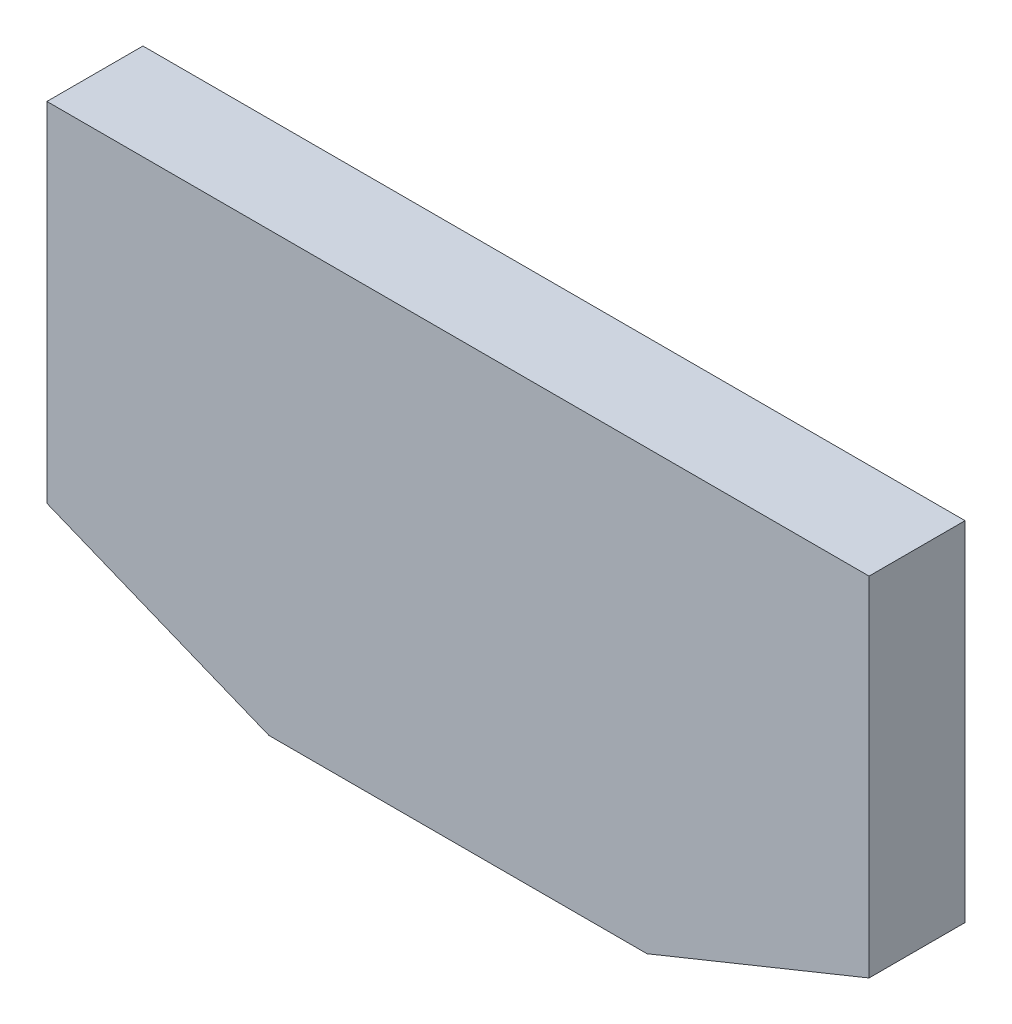
ISO-10303-21;
HEADER;
FILE_DESCRIPTION(('STEP AP214'),'2;1');
FILE_NAME('part.step','',(''),(''),'','','');
FILE_SCHEMA(('AUTOMOTIVE_DESIGN { 1 0 10303 214 1 1 1 1 }'));
ENDSEC;
DATA;
#1=APPLICATION_CONTEXT('core data for automotive mechanical design processes');
#2=APPLICATION_PROTOCOL_DEFINITION('international standard','automotive_design',2000,#1);
#3=PRODUCT_CONTEXT('',#1,'mechanical');
#4=PRODUCT('Part','Part','',(#3));
#5=PRODUCT_RELATED_PRODUCT_CATEGORY('part','',(#4));
#6=PRODUCT_DEFINITION_FORMATION('','',#4);
#7=PRODUCT_DEFINITION_CONTEXT('part definition',#1,'design');
#8=PRODUCT_DEFINITION('design','',#6,#7);
#9=PRODUCT_DEFINITION_SHAPE('','',#8);
#10=(LENGTH_UNIT() NAMED_UNIT(*) SI_UNIT(.MILLI.,.METRE.));
#11=(NAMED_UNIT(*) PLANE_ANGLE_UNIT() SI_UNIT($,.RADIAN.));
#12=(NAMED_UNIT(*) SI_UNIT($,.STERADIAN.) SOLID_ANGLE_UNIT());
#13=UNCERTAINTY_MEASURE_WITH_UNIT(LENGTH_MEASURE(1.E-05),#10,'distance_accuracy_value','');
#14=(GEOMETRIC_REPRESENTATION_CONTEXT(3) GLOBAL_UNCERTAINTY_ASSIGNED_CONTEXT((#13)) GLOBAL_UNIT_ASSIGNED_CONTEXT((#10,
#11,#12)) REPRESENTATION_CONTEXT('',''));
#15=CARTESIAN_POINT('',(0.,0.,0.));
#16=DIRECTION('',(0.,0.,1.));
#17=DIRECTION('',(1.,0.,0.));
#18=AXIS2_PLACEMENT_3D('',#15,#16,#17);
#19=CARTESIAN_POINT('',(685.,365.,0.));
#20=DIRECTION('',(0.,0.,1.));
#21=DIRECTION('',(1.,0.,0.));
#22=AXIS2_PLACEMENT_3D('',#19,#20,#21);
#23=PLANE('',#22);
#24=DIRECTION('',(-1.,0.,0.));
#25=VECTOR('',#24,1.);
#26=CARTESIAN_POINT('',(685.,75.,0.));
#27=LINE('',#26,#25);
#28=CARTESIAN_POINT('',(685.,75.,0.));
#29=VERTEX_POINT('',#28);
#30=CARTESIAN_POINT('',(0.,75.,0.));
#31=VERTEX_POINT('',#30);
#32=EDGE_CURVE('E71',#29,#31,#27,.T.);
#33=ORIENTED_EDGE('',*,*,#32,.F.);
#34=DIRECTION('',(0.926739268223405,0.375705108739218,0.));
#35=VECTOR('',#34,1.);
#36=CARTESIAN_POINT('',(685.,75.,0.));
#37=LINE('',#36,#35);
#38=CARTESIAN_POINT('',(500.,0.,0.));
#39=VERTEX_POINT('',#38);
#40=EDGE_CURVE('E115',#39,#29,#37,.T.);
#41=ORIENTED_EDGE('',*,*,#40,.F.);
#42=DIRECTION('',(1.,0.,0.));
#43=VECTOR('',#42,1.);
#44=CARTESIAN_POINT('',(185.,0.,0.));
#45=LINE('',#44,#43);
#46=CARTESIAN_POINT('',(185.,0.,0.));
#47=VERTEX_POINT('',#46);
#48=EDGE_CURVE('E63',#47,#39,#45,.T.);
#49=ORIENTED_EDGE('',*,*,#48,.F.);
#50=DIRECTION('',(0.926739268223405,-0.375705108739218,0.));
#51=VECTOR('',#50,1.);
#52=CARTESIAN_POINT('',(0.,75.,0.));
#53=LINE('',#52,#51);
#54=EDGE_CURVE('E111',#31,#47,#53,.T.);
#55=ORIENTED_EDGE('',*,*,#54,.F.);
#56=EDGE_LOOP('',(#33,#41,#49,#55));
#57=FACE_BOUND('',#56,.T.);
#58=ADVANCED_FACE('F31',(#57),#23,.F.);
#59=CARTESIAN_POINT('',(0.,365.,7.));
#60=DIRECTION('',(0.,-1.,0.));
#61=DIRECTION('',(0.,0.,-1.));
#62=AXIS2_PLACEMENT_3D('',#59,#60,#61);
#63=PLANE('',#62);
#64=DIRECTION('',(0.,0.,-1.));
#65=VECTOR('',#64,1.);
#66=CARTESIAN_POINT('',(685.,365.,7.));
#67=LINE('',#66,#65);
#68=CARTESIAN_POINT('',(685.,365.,7.));
#69=VERTEX_POINT('',#68);
#70=CARTESIAN_POINT('',(685.,365.,-73.));
#71=VERTEX_POINT('',#70);
#72=EDGE_CURVE('E107',#69,#71,#67,.T.);
#73=ORIENTED_EDGE('',*,*,#72,.T.);
#74=DIRECTION('',(1.,0.,0.));
#75=VECTOR('',#74,1.);
#76=CARTESIAN_POINT('',(0.,365.,-73.));
#77=LINE('',#76,#75);
#78=CARTESIAN_POINT('',(0.,365.,-73.));
#79=VERTEX_POINT('',#78);
#80=EDGE_CURVE('E151',#79,#71,#77,.T.);
#81=ORIENTED_EDGE('',*,*,#80,.F.);
#82=DIRECTION('',(0.,0.,-1.));
#83=VECTOR('',#82,1.);
#84=CARTESIAN_POINT('',(0.,365.,7.));
#85=LINE('',#84,#83);
#86=CARTESIAN_POINT('',(0.,365.,7.));
#87=VERTEX_POINT('',#86);
#88=EDGE_CURVE('E11',#87,#79,#85,.T.);
#89=ORIENTED_EDGE('',*,*,#88,.F.);
#90=DIRECTION('',(-1.,0.,0.));
#91=VECTOR('',#90,1.);
#92=CARTESIAN_POINT('',(0.,365.,7.));
#93=LINE('',#92,#91);
#94=EDGE_CURVE('E117',#69,#87,#93,.T.);
#95=ORIENTED_EDGE('',*,*,#94,.F.);
#96=EDGE_LOOP('',(#73,#81,#89,#95));
#97=FACE_BOUND('',#96,.T.);
#98=ADVANCED_FACE('F33',(#97),#63,.F.);
#99=CARTESIAN_POINT('',(0.,75.,7.));
#100=DIRECTION('',(1.,0.,0.));
#101=DIRECTION('',(0.,0.,-1.));
#102=AXIS2_PLACEMENT_3D('',#99,#100,#101);
#103=PLANE('',#102);
#104=ORIENTED_EDGE('',*,*,#88,.T.);
#105=DIRECTION('',(0.,1.,0.));
#106=VECTOR('',#105,1.);
#107=CARTESIAN_POINT('',(0.,75.,-73.));
#108=LINE('',#107,#106);
#109=CARTESIAN_POINT('',(0.,75.,-73.));
#110=VERTEX_POINT('',#109);
#111=EDGE_CURVE('E134',#110,#79,#108,.T.);
#112=ORIENTED_EDGE('',*,*,#111,.F.);
#113=DIRECTION('',(0.,0.,1.));
#114=VECTOR('',#113,1.);
#115=CARTESIAN_POINT('',(0.,75.,-73.));
#116=LINE('',#115,#114);
#117=EDGE_CURVE('E131',#110,#31,#116,.T.);
#118=ORIENTED_EDGE('',*,*,#117,.T.);
#119=DIRECTION('',(0.,0.,-1.));
#120=VECTOR('',#119,1.);
#121=CARTESIAN_POINT('',(0.,75.,7.));
#122=LINE('',#121,#120);
#123=CARTESIAN_POINT('',(0.,75.,7.));
#124=VERTEX_POINT('',#123);
#125=EDGE_CURVE('E40',#124,#31,#122,.T.);
#126=ORIENTED_EDGE('',*,*,#125,.F.);
#127=DIRECTION('',(0.,-1.,0.));
#128=VECTOR('',#127,1.);
#129=CARTESIAN_POINT('',(0.,75.,7.));
#130=LINE('',#129,#128);
#131=EDGE_CURVE('E79',#87,#124,#130,.T.);
#132=ORIENTED_EDGE('',*,*,#131,.F.);
#133=EDGE_LOOP('',(#104,#112,#118,#126,#132));
#134=FACE_BOUND('',#133,.T.);
#135=ADVANCED_FACE('F136',(#134),#103,.F.);
#136=CARTESIAN_POINT('',(0.,75.,7.));
#137=DIRECTION('',(0.375705108739218,0.926739268223405,0.));
#138=DIRECTION('',(-0.926739268223405,0.375705108739218,0.));
#139=AXIS2_PLACEMENT_3D('',#136,#137,#138);
#140=PLANE('',#139);
#141=ORIENTED_EDGE('',*,*,#54,.T.);
#142=DIRECTION('',(0.,0.,-1.));
#143=VECTOR('',#142,1.);
#144=CARTESIAN_POINT('',(185.,0.,7.));
#145=LINE('',#144,#143);
#146=CARTESIAN_POINT('',(185.,0.,7.));
#147=VERTEX_POINT('',#146);
#148=EDGE_CURVE('E101',#147,#47,#145,.T.);
#149=ORIENTED_EDGE('',*,*,#148,.F.);
#150=DIRECTION('',(0.926739268223405,-0.375705108739218,0.));
#151=VECTOR('',#150,1.);
#152=CARTESIAN_POINT('',(0.,75.,7.));
#153=LINE('',#152,#151);
#154=EDGE_CURVE('E95',#124,#147,#153,.T.);
#155=ORIENTED_EDGE('',*,*,#154,.F.);
#156=ORIENTED_EDGE('',*,*,#125,.T.);
#157=EDGE_LOOP('',(#141,#149,#155,#156));
#158=FACE_BOUND('',#157,.T.);
#159=ADVANCED_FACE('F123',(#158),#140,.F.);
#160=CARTESIAN_POINT('',(185.,0.,7.));
#161=DIRECTION('',(0.,1.,0.));
#162=DIRECTION('',(0.,0.,1.));
#163=AXIS2_PLACEMENT_3D('',#160,#161,#162);
#164=PLANE('',#163);
#165=ORIENTED_EDGE('',*,*,#48,.T.);
#166=DIRECTION('',(0.,0.,-1.));
#167=VECTOR('',#166,1.);
#168=CARTESIAN_POINT('',(500.,0.,7.));
#169=LINE('',#168,#167);
#170=CARTESIAN_POINT('',(500.,0.,7.));
#171=VERTEX_POINT('',#170);
#172=EDGE_CURVE('E98',#171,#39,#169,.T.);
#173=ORIENTED_EDGE('',*,*,#172,.F.);
#174=DIRECTION('',(1.,0.,0.));
#175=VECTOR('',#174,1.);
#176=CARTESIAN_POINT('',(185.,0.,7.));
#177=LINE('',#176,#175);
#178=EDGE_CURVE('E89',#147,#171,#177,.T.);
#179=ORIENTED_EDGE('',*,*,#178,.F.);
#180=ORIENTED_EDGE('',*,*,#148,.T.);
#181=EDGE_LOOP('',(#165,#173,#179,#180));
#182=FACE_BOUND('',#181,.T.);
#183=ADVANCED_FACE('F99',(#182),#164,.F.);
#184=CARTESIAN_POINT('',(685.,75.,7.));
#185=DIRECTION('',(-0.375705108739218,0.926739268223405,0.));
#186=DIRECTION('',(-0.926739268223405,-0.375705108739218,0.));
#187=AXIS2_PLACEMENT_3D('',#184,#185,#186);
#188=PLANE('',#187);
#189=ORIENTED_EDGE('',*,*,#40,.T.);
#190=DIRECTION('',(0.,0.,-1.));
#191=VECTOR('',#190,1.);
#192=CARTESIAN_POINT('',(685.,75.,7.));
#193=LINE('',#192,#191);
#194=CARTESIAN_POINT('',(685.,75.,7.));
#195=VERTEX_POINT('',#194);
#196=EDGE_CURVE('E102',#195,#29,#193,.T.);
#197=ORIENTED_EDGE('',*,*,#196,.F.);
#198=DIRECTION('',(0.926739268223405,0.375705108739218,0.));
#199=VECTOR('',#198,1.);
#200=CARTESIAN_POINT('',(685.,75.,7.));
#201=LINE('',#200,#199);
#202=EDGE_CURVE('E92',#171,#195,#201,.T.);
#203=ORIENTED_EDGE('',*,*,#202,.F.);
#204=ORIENTED_EDGE('',*,*,#172,.T.);
#205=EDGE_LOOP('',(#189,#197,#203,#204));
#206=FACE_BOUND('',#205,.T.);
#207=ADVANCED_FACE('F104',(#206),#188,.F.);
#208=CARTESIAN_POINT('',(685.,75.,7.));
#209=DIRECTION('',(-1.,0.,0.));
#210=DIRECTION('',(0.,0.,1.));
#211=AXIS2_PLACEMENT_3D('',#208,#209,#210);
#212=PLANE('',#211);
#213=ORIENTED_EDGE('',*,*,#196,.T.);
#214=DIRECTION('',(0.,0.,1.));
#215=VECTOR('',#214,1.);
#216=CARTESIAN_POINT('',(685.,75.,-73.));
#217=LINE('',#216,#215);
#218=CARTESIAN_POINT('',(685.,75.,-73.));
#219=VERTEX_POINT('',#218);
#220=EDGE_CURVE('E113',#219,#29,#217,.T.);
#221=ORIENTED_EDGE('',*,*,#220,.F.);
#222=DIRECTION('',(0.,-1.,0.));
#223=VECTOR('',#222,1.);
#224=CARTESIAN_POINT('',(685.,365.,-73.));
#225=LINE('',#224,#223);
#226=EDGE_CURVE('E142',#71,#219,#225,.T.);
#227=ORIENTED_EDGE('',*,*,#226,.F.);
#228=ORIENTED_EDGE('',*,*,#72,.F.);
#229=DIRECTION('',(0.,1.,0.));
#230=VECTOR('',#229,1.);
#231=CARTESIAN_POINT('',(685.,75.,7.));
#232=LINE('',#231,#230);
#233=EDGE_CURVE('E48',#195,#69,#232,.T.);
#234=ORIENTED_EDGE('',*,*,#233,.F.);
#235=EDGE_LOOP('',(#213,#221,#227,#228,#234));
#236=FACE_BOUND('',#235,.T.);
#237=ADVANCED_FACE('F163',(#236),#212,.F.);
#238=CARTESIAN_POINT('',(685.,365.,7.));
#239=DIRECTION('',(0.,0.,1.));
#240=DIRECTION('',(1.,0.,0.));
#241=AXIS2_PLACEMENT_3D('',#238,#239,#240);
#242=PLANE('',#241);
#243=ORIENTED_EDGE('',*,*,#94,.T.);
#244=ORIENTED_EDGE('',*,*,#131,.T.);
#245=ORIENTED_EDGE('',*,*,#154,.T.);
#246=ORIENTED_EDGE('',*,*,#178,.T.);
#247=ORIENTED_EDGE('',*,*,#202,.T.);
#248=ORIENTED_EDGE('',*,*,#233,.T.);
#249=EDGE_LOOP('',(#243,#244,#245,#246,#247,#248));
#250=FACE_BOUND('',#249,.T.);
#251=ADVANCED_FACE('F90',(#250),#242,.T.);
#252=CARTESIAN_POINT('',(685.,75.,-73.));
#253=DIRECTION('',(0.,1.,0.));
#254=DIRECTION('',(-1.,0.,0.));
#255=AXIS2_PLACEMENT_3D('',#252,#253,#254);
#256=PLANE('',#255);
#257=ORIENTED_EDGE('',*,*,#32,.T.);
#258=ORIENTED_EDGE('',*,*,#117,.F.);
#259=DIRECTION('',(-1.,0.,0.));
#260=VECTOR('',#259,1.);
#261=CARTESIAN_POINT('',(685.,75.,-73.));
#262=LINE('',#261,#260);
#263=EDGE_CURVE('E138',#219,#110,#262,.T.);
#264=ORIENTED_EDGE('',*,*,#263,.F.);
#265=ORIENTED_EDGE('',*,*,#220,.T.);
#266=EDGE_LOOP('',(#257,#258,#264,#265));
#267=FACE_BOUND('',#266,.T.);
#268=ADVANCED_FACE('F129',(#267),#256,.F.);
#269=CARTESIAN_POINT('',(0.,365.,-73.));
#270=DIRECTION('',(0.,0.,-1.));
#271=DIRECTION('',(-1.,0.,0.));
#272=AXIS2_PLACEMENT_3D('',#269,#270,#271);
#273=PLANE('',#272);
#274=ORIENTED_EDGE('',*,*,#111,.T.);
#275=ORIENTED_EDGE('',*,*,#80,.T.);
#276=ORIENTED_EDGE('',*,*,#226,.T.);
#277=ORIENTED_EDGE('',*,*,#263,.T.);
#278=EDGE_LOOP('',(#274,#275,#276,#277));
#279=FACE_BOUND('',#278,.T.);
#280=ADVANCED_FACE('F159',(#279),#273,.T.);
#281=CLOSED_SHELL('',(#58,#98,#135,#159,#183,#207,#237,#251,#268,#280));
#282=MANIFOLD_SOLID_BREP('B2',#281);
#283=ADVANCED_BREP_SHAPE_REPRESENTATION('',(#18,#282),#14);
#284=SHAPE_DEFINITION_REPRESENTATION(#9,#283);
ENDSEC;
END-ISO-10303-21;
